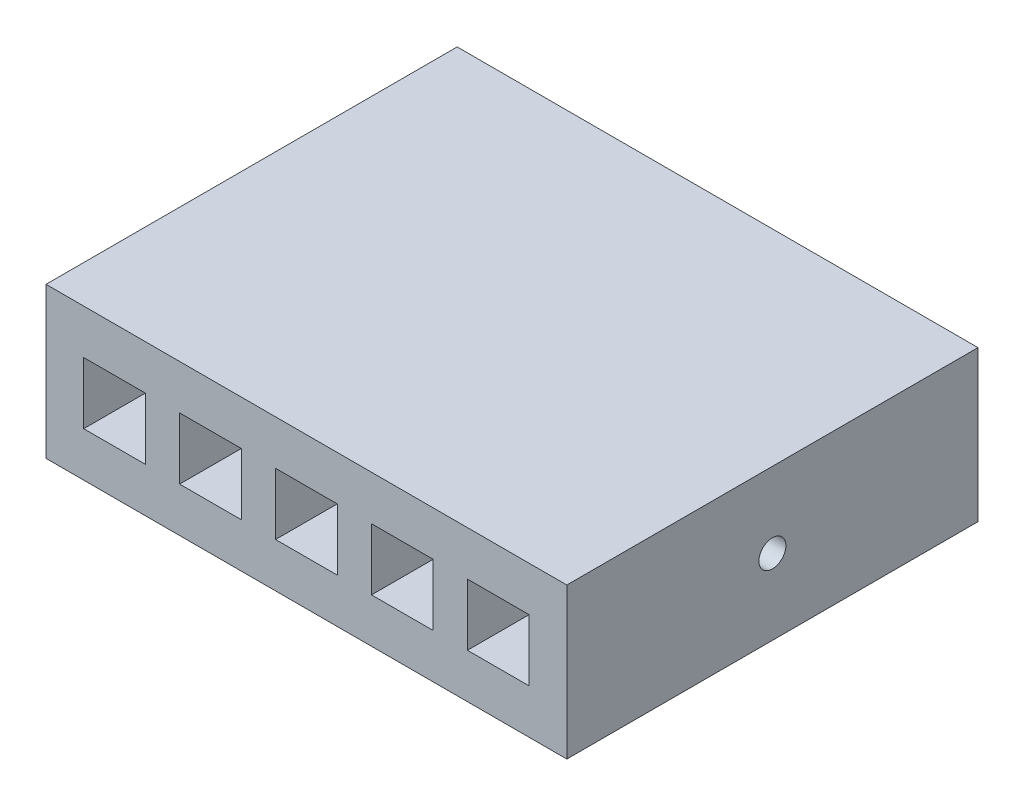
ISO-10303-21;
HEADER;
FILE_DESCRIPTION(('STEP AP214'),'2;1');
FILE_NAME('part.step','',(''),(''),'','','');
FILE_SCHEMA(('AUTOMOTIVE_DESIGN { 1 0 10303 214 1 1 1 1 }'));
ENDSEC;
DATA;
#1=APPLICATION_CONTEXT('core data for automotive mechanical design processes');
#2=APPLICATION_PROTOCOL_DEFINITION('international standard','automotive_design',2000,#1);
#3=PRODUCT_CONTEXT('',#1,'mechanical');
#4=PRODUCT('Part','Part','',(#3));
#5=PRODUCT_RELATED_PRODUCT_CATEGORY('part','',(#4));
#6=PRODUCT_DEFINITION_FORMATION('','',#4);
#7=PRODUCT_DEFINITION_CONTEXT('part definition',#1,'design');
#8=PRODUCT_DEFINITION('design','',#6,#7);
#9=PRODUCT_DEFINITION_SHAPE('','',#8);
#10=(LENGTH_UNIT() NAMED_UNIT(*) SI_UNIT(.MILLI.,.METRE.));
#11=(NAMED_UNIT(*) PLANE_ANGLE_UNIT() SI_UNIT($,.RADIAN.));
#12=(NAMED_UNIT(*) SI_UNIT($,.STERADIAN.) SOLID_ANGLE_UNIT());
#13=UNCERTAINTY_MEASURE_WITH_UNIT(LENGTH_MEASURE(1.E-05),#10,'distance_accuracy_value','');
#14=(GEOMETRIC_REPRESENTATION_CONTEXT(3) GLOBAL_UNCERTAINTY_ASSIGNED_CONTEXT((#13)) GLOBAL_UNIT_ASSIGNED_CONTEXT((#10,
#11,#12)) REPRESENTATION_CONTEXT('',''));
#15=CARTESIAN_POINT('',(0.,0.,0.));
#16=DIRECTION('',(0.,0.,1.));
#17=DIRECTION('',(1.,0.,0.));
#18=AXIS2_PLACEMENT_3D('',#15,#16,#17);
#19=CARTESIAN_POINT('',(0.,27.94,0.));
#20=DIRECTION('',(0.,0.,-1.));
#21=DIRECTION('',(-1.,0.,0.));
#22=AXIS2_PLACEMENT_3D('',#19,#20,#21);
#23=PLANE('',#22);
#24=DIRECTION('',(0.,-1.,0.));
#25=VECTOR('',#24,1.);
#26=CARTESIAN_POINT('',(71.755,0.,0.));
#27=LINE('',#26,#25);
#28=CARTESIAN_POINT('',(71.755,19.685,0.));
#29=VERTEX_POINT('',#28);
#30=CARTESIAN_POINT('',(71.755,8.255,0.));
#31=VERTEX_POINT('',#30);
#32=EDGE_CURVE('E57',#29,#31,#27,.T.);
#33=ORIENTED_EDGE('',*,*,#32,.T.);
#34=DIRECTION('',(1.,0.,0.));
#35=VECTOR('',#34,1.);
#36=CARTESIAN_POINT('',(0.,8.255,0.));
#37=LINE('',#36,#35);
#38=CARTESIAN_POINT('',(60.325,8.255,0.));
#39=VERTEX_POINT('',#38);
#40=EDGE_CURVE('E241',#39,#31,#37,.T.);
#41=ORIENTED_EDGE('',*,*,#40,.F.);
#42=DIRECTION('',(0.,-1.,0.));
#43=VECTOR('',#42,1.);
#44=CARTESIAN_POINT('',(60.325,0.,0.));
#45=LINE('',#44,#43);
#46=CARTESIAN_POINT('',(60.325,19.685,0.));
#47=VERTEX_POINT('',#46);
#48=EDGE_CURVE('E254',#47,#39,#45,.T.);
#49=ORIENTED_EDGE('',*,*,#48,.F.);
#50=DIRECTION('',(1.,0.,0.));
#51=VECTOR('',#50,1.);
#52=CARTESIAN_POINT('',(0.,19.685,0.));
#53=LINE('',#52,#51);
#54=EDGE_CURVE('E251',#47,#29,#53,.T.);
#55=ORIENTED_EDGE('',*,*,#54,.T.);
#56=EDGE_LOOP('',(#33,#41,#49,#55));
#57=FACE_BOUND('',#56,.T.);
#58=DIRECTION('',(0.,-1.,0.));
#59=VECTOR('',#58,1.);
#60=CARTESIAN_POINT('',(36.195,0.,0.));
#61=LINE('',#60,#59);
#62=CARTESIAN_POINT('',(36.195,19.685,0.));
#63=VERTEX_POINT('',#62);
#64=CARTESIAN_POINT('',(36.195,8.255,0.));
#65=VERTEX_POINT('',#64);
#66=EDGE_CURVE('E291',#63,#65,#61,.T.);
#67=ORIENTED_EDGE('',*,*,#66,.T.);
#68=DIRECTION('',(1.,0.,0.));
#69=VECTOR('',#68,1.);
#70=CARTESIAN_POINT('',(0.,8.255,0.));
#71=LINE('',#70,#69);
#72=CARTESIAN_POINT('',(24.765,8.255,0.));
#73=VERTEX_POINT('',#72);
#74=EDGE_CURVE('E301',#73,#65,#71,.T.);
#75=ORIENTED_EDGE('',*,*,#74,.F.);
#76=DIRECTION('',(0.,-1.,0.));
#77=VECTOR('',#76,1.);
#78=CARTESIAN_POINT('',(24.765,0.,0.));
#79=LINE('',#78,#77);
#80=CARTESIAN_POINT('',(24.765,19.685,0.));
#81=VERTEX_POINT('',#80);
#82=EDGE_CURVE('E315',#81,#73,#79,.T.);
#83=ORIENTED_EDGE('',*,*,#82,.F.);
#84=DIRECTION('',(1.,0.,0.));
#85=VECTOR('',#84,1.);
#86=CARTESIAN_POINT('',(0.,19.685,0.));
#87=LINE('',#86,#85);
#88=EDGE_CURVE('E312',#81,#63,#87,.T.);
#89=ORIENTED_EDGE('',*,*,#88,.T.);
#90=EDGE_LOOP('',(#67,#75,#83,#89));
#91=FACE_BOUND('',#90,.T.);
#92=DIRECTION('',(1.,0.,0.));
#93=VECTOR('',#92,1.);
#94=CARTESIAN_POINT('',(0.,0.,0.));
#95=LINE('',#94,#93);
#96=CARTESIAN_POINT('',(0.,0.,0.));
#97=VERTEX_POINT('',#96);
#98=CARTESIAN_POINT('',(96.52,0.,0.));
#99=VERTEX_POINT('',#98);
#100=EDGE_CURVE('E373',#97,#99,#95,.T.);
#101=ORIENTED_EDGE('',*,*,#100,.T.);
#102=DIRECTION('',(0.,-1.,0.));
#103=VECTOR('',#102,1.);
#104=CARTESIAN_POINT('',(96.52,27.94,0.));
#105=LINE('',#104,#103);
#106=CARTESIAN_POINT('',(96.52,27.94,0.));
#107=VERTEX_POINT('',#106);
#108=EDGE_CURVE('E42',#107,#99,#105,.T.);
#109=ORIENTED_EDGE('',*,*,#108,.F.);
#110=DIRECTION('',(1.,0.,0.));
#111=VECTOR('',#110,1.);
#112=CARTESIAN_POINT('',(0.,27.94,0.));
#113=LINE('',#112,#111);
#114=CARTESIAN_POINT('',(0.,27.94,0.));
#115=VERTEX_POINT('',#114);
#116=EDGE_CURVE('E363',#115,#107,#113,.T.);
#117=ORIENTED_EDGE('',*,*,#116,.F.);
#118=DIRECTION('',(0.,-1.,0.));
#119=VECTOR('',#118,1.);
#120=CARTESIAN_POINT('',(0.,27.94,0.));
#121=LINE('',#120,#119);
#122=EDGE_CURVE('E11',#115,#97,#121,.T.);
#123=ORIENTED_EDGE('',*,*,#122,.T.);
#124=EDGE_LOOP('',(#101,#109,#117,#123));
#125=FACE_BOUND('',#124,.T.);
#126=DIRECTION('',(0.,-1.,0.));
#127=VECTOR('',#126,1.);
#128=CARTESIAN_POINT('',(18.415,0.,0.));
#129=LINE('',#128,#127);
#130=CARTESIAN_POINT('',(18.415,19.685,0.));
#131=VERTEX_POINT('',#130);
#132=CARTESIAN_POINT('',(18.415,8.255,0.));
#133=VERTEX_POINT('',#132);
#134=EDGE_CURVE('E322',#131,#133,#129,.T.);
#135=ORIENTED_EDGE('',*,*,#134,.T.);
#136=DIRECTION('',(1.,0.,0.));
#137=VECTOR('',#136,1.);
#138=CARTESIAN_POINT('',(0.,8.255,0.));
#139=LINE('',#138,#137);
#140=CARTESIAN_POINT('',(6.985,8.255,0.));
#141=VERTEX_POINT('',#140);
#142=EDGE_CURVE('E332',#141,#133,#139,.T.);
#143=ORIENTED_EDGE('',*,*,#142,.F.);
#144=DIRECTION('',(0.,-1.,0.));
#145=VECTOR('',#144,1.);
#146=CARTESIAN_POINT('',(6.985,0.,0.));
#147=LINE('',#146,#145);
#148=CARTESIAN_POINT('',(6.985,19.685,0.));
#149=VERTEX_POINT('',#148);
#150=EDGE_CURVE('E346',#149,#141,#147,.T.);
#151=ORIENTED_EDGE('',*,*,#150,.F.);
#152=DIRECTION('',(1.,0.,0.));
#153=VECTOR('',#152,1.);
#154=CARTESIAN_POINT('',(0.,19.685,0.));
#155=LINE('',#154,#153);
#156=EDGE_CURVE('E343',#149,#131,#155,.T.);
#157=ORIENTED_EDGE('',*,*,#156,.T.);
#158=EDGE_LOOP('',(#135,#143,#151,#157));
#159=FACE_BOUND('',#158,.T.);
#160=DIRECTION('',(0.,-1.,0.));
#161=VECTOR('',#160,1.);
#162=CARTESIAN_POINT('',(53.975,0.,0.));
#163=LINE('',#162,#161);
#164=CARTESIAN_POINT('',(53.975,19.685,0.));
#165=VERTEX_POINT('',#164);
#166=CARTESIAN_POINT('',(53.975,8.255,0.));
#167=VERTEX_POINT('',#166);
#168=EDGE_CURVE('E261',#165,#167,#163,.T.);
#169=ORIENTED_EDGE('',*,*,#168,.T.);
#170=DIRECTION('',(1.,0.,0.));
#171=VECTOR('',#170,1.);
#172=CARTESIAN_POINT('',(0.,8.255,0.));
#173=LINE('',#172,#171);
#174=CARTESIAN_POINT('',(42.545,8.255,0.));
#175=VERTEX_POINT('',#174);
#176=EDGE_CURVE('E270',#175,#167,#173,.T.);
#177=ORIENTED_EDGE('',*,*,#176,.F.);
#178=DIRECTION('',(0.,-1.,0.));
#179=VECTOR('',#178,1.);
#180=CARTESIAN_POINT('',(42.545,0.,0.));
#181=LINE('',#180,#179);
#182=CARTESIAN_POINT('',(42.545,19.685,0.));
#183=VERTEX_POINT('',#182);
#184=EDGE_CURVE('E284',#183,#175,#181,.T.);
#185=ORIENTED_EDGE('',*,*,#184,.F.);
#186=DIRECTION('',(1.,0.,0.));
#187=VECTOR('',#186,1.);
#188=CARTESIAN_POINT('',(0.,19.685,0.));
#189=LINE('',#188,#187);
#190=EDGE_CURVE('E281',#183,#165,#189,.T.);
#191=ORIENTED_EDGE('',*,*,#190,.T.);
#192=EDGE_LOOP('',(#169,#177,#185,#191));
#193=FACE_BOUND('',#192,.T.);
#194=DIRECTION('',(0.,-1.,0.));
#195=VECTOR('',#194,1.);
#196=CARTESIAN_POINT('',(89.535,0.,0.));
#197=LINE('',#196,#195);
#198=CARTESIAN_POINT('',(89.535,19.685,0.));
#199=VERTEX_POINT('',#198);
#200=CARTESIAN_POINT('',(89.535,8.255,0.));
#201=VERTEX_POINT('',#200);
#202=EDGE_CURVE('E49',#199,#201,#197,.T.);
#203=ORIENTED_EDGE('',*,*,#202,.T.);
#204=DIRECTION('',(1.,0.,0.));
#205=VECTOR('',#204,1.);
#206=CARTESIAN_POINT('',(0.,8.255,0.));
#207=LINE('',#206,#205);
#208=CARTESIAN_POINT('',(78.105,8.255,0.));
#209=VERTEX_POINT('',#208);
#210=EDGE_CURVE('E216',#209,#201,#207,.T.);
#211=ORIENTED_EDGE('',*,*,#210,.F.);
#212=DIRECTION('',(0.,-1.,0.));
#213=VECTOR('',#212,1.);
#214=CARTESIAN_POINT('',(78.105,0.,0.));
#215=LINE('',#214,#213);
#216=CARTESIAN_POINT('',(78.105,19.685,0.));
#217=VERTEX_POINT('',#216);
#218=EDGE_CURVE('E219',#217,#209,#215,.T.);
#219=ORIENTED_EDGE('',*,*,#218,.F.);
#220=DIRECTION('',(1.,0.,0.));
#221=VECTOR('',#220,1.);
#222=CARTESIAN_POINT('',(0.,19.685,0.));
#223=LINE('',#222,#221);
#224=EDGE_CURVE('E228',#217,#199,#223,.T.);
#225=ORIENTED_EDGE('',*,*,#224,.T.);
#226=EDGE_LOOP('',(#203,#211,#219,#225));
#227=FACE_BOUND('',#226,.T.);
#228=ADVANCED_FACE('F34',(#57,#91,#125,#159,#193,#227),#23,.F.);
#229=CARTESIAN_POINT('',(0.,27.94,0.));
#230=DIRECTION('',(1.,0.,0.));
#231=DIRECTION('',(0.,0.,-1.));
#232=AXIS2_PLACEMENT_3D('',#229,#230,#231);
#233=PLANE('',#232);
#234=DIRECTION('',(0.,0.,1.));
#235=VECTOR('',#234,1.);
#236=CARTESIAN_POINT('',(0.,0.,0.));
#237=LINE('',#236,#235);
#238=CARTESIAN_POINT('',(0.,0.,-76.2));
#239=VERTEX_POINT('',#238);
#240=EDGE_CURVE('E353',#239,#97,#237,.T.);
#241=ORIENTED_EDGE('',*,*,#240,.T.);
#242=ORIENTED_EDGE('',*,*,#122,.F.);
#243=DIRECTION('',(0.,0.,1.));
#244=VECTOR('',#243,1.);
#245=CARTESIAN_POINT('',(0.,27.94,0.));
#246=LINE('',#245,#244);
#247=CARTESIAN_POINT('',(0.,27.94,-76.2));
#248=VERTEX_POINT('',#247);
#249=EDGE_CURVE('E360',#248,#115,#246,.T.);
#250=ORIENTED_EDGE('',*,*,#249,.F.);
#251=DIRECTION('',(0.,-1.,0.));
#252=VECTOR('',#251,1.);
#253=CARTESIAN_POINT('',(0.,27.94,-76.2));
#254=LINE('',#253,#252);
#255=EDGE_CURVE('E370',#248,#239,#254,.T.);
#256=ORIENTED_EDGE('',*,*,#255,.T.);
#257=EDGE_LOOP('',(#241,#242,#250,#256));
#258=FACE_BOUND('',#257,.T.);
#259=ADVANCED_FACE('F36',(#258),#233,.F.);
#260=CARTESIAN_POINT('',(96.52,27.94,0.));
#261=DIRECTION('',(-1.,0.,0.));
#262=DIRECTION('',(0.,0.,1.));
#263=AXIS2_PLACEMENT_3D('',#260,#261,#262);
#264=PLANE('',#263);
#265=CARTESIAN_POINT('',(96.52,13.97,-38.1));
#266=DIRECTION('',(1.,0.,0.));
#267=DIRECTION('',(0.,0.,-1.));
#268=AXIS2_PLACEMENT_3D('',#265,#266,#267);
#269=CIRCLE('',#268,2.5);
#270=CARTESIAN_POINT('',(96.52,13.97,-40.6));
#271=VERTEX_POINT('',#270);
#272=EDGE_CURVE('E222',#271,#271,#269,.T.);
#273=ORIENTED_EDGE('',*,*,#272,.F.);
#274=EDGE_LOOP('',(#273));
#275=FACE_BOUND('',#274,.T.);
#276=DIRECTION('',(0.,0.,-1.));
#277=VECTOR('',#276,1.);
#278=CARTESIAN_POINT('',(96.52,0.,0.));
#279=LINE('',#278,#277);
#280=CARTESIAN_POINT('',(96.52,0.,-76.2));
#281=VERTEX_POINT('',#280);
#282=EDGE_CURVE('E375',#99,#281,#279,.T.);
#283=ORIENTED_EDGE('',*,*,#282,.T.);
#284=DIRECTION('',(0.,-1.,0.));
#285=VECTOR('',#284,1.);
#286=CARTESIAN_POINT('',(96.52,27.94,-76.2));
#287=LINE('',#286,#285);
#288=CARTESIAN_POINT('',(96.52,27.94,-76.2));
#289=VERTEX_POINT('',#288);
#290=EDGE_CURVE('E380',#289,#281,#287,.T.);
#291=ORIENTED_EDGE('',*,*,#290,.F.);
#292=DIRECTION('',(0.,0.,-1.));
#293=VECTOR('',#292,1.);
#294=CARTESIAN_POINT('',(96.52,27.94,0.));
#295=LINE('',#294,#293);
#296=EDGE_CURVE('E366',#107,#289,#295,.T.);
#297=ORIENTED_EDGE('',*,*,#296,.F.);
#298=ORIENTED_EDGE('',*,*,#108,.T.);
#299=EDGE_LOOP('',(#283,#291,#297,#298));
#300=FACE_BOUND('',#299,.T.);
#301=ADVANCED_FACE('F387',(#275,#300),#264,.F.);
#302=CARTESIAN_POINT('',(0.,27.94,-76.2));
#303=DIRECTION('',(0.,0.,1.));
#304=DIRECTION('',(1.,0.,0.));
#305=AXIS2_PLACEMENT_3D('',#302,#303,#304);
#306=PLANE('',#305);
#307=DIRECTION('',(-1.,0.,0.));
#308=VECTOR('',#307,1.);
#309=CARTESIAN_POINT('',(0.,0.,-76.2));
#310=LINE('',#309,#308);
#311=EDGE_CURVE('E364',#281,#239,#310,.T.);
#312=ORIENTED_EDGE('',*,*,#311,.T.);
#313=ORIENTED_EDGE('',*,*,#255,.F.);
#314=DIRECTION('',(-1.,0.,0.));
#315=VECTOR('',#314,1.);
#316=CARTESIAN_POINT('',(0.,27.94,-76.2));
#317=LINE('',#316,#315);
#318=EDGE_CURVE('E368',#289,#248,#317,.T.);
#319=ORIENTED_EDGE('',*,*,#318,.F.);
#320=ORIENTED_EDGE('',*,*,#290,.T.);
#321=EDGE_LOOP('',(#312,#313,#319,#320));
#322=FACE_BOUND('',#321,.T.);
#323=ADVANCED_FACE('F396',(#322),#306,.F.);
#324=CARTESIAN_POINT('',(0.,27.94,0.));
#325=DIRECTION('',(0.,-1.,0.));
#326=DIRECTION('',(0.,0.,-1.));
#327=AXIS2_PLACEMENT_3D('',#324,#325,#326);
#328=PLANE('',#327);
#329=ORIENTED_EDGE('',*,*,#249,.T.);
#330=ORIENTED_EDGE('',*,*,#116,.T.);
#331=ORIENTED_EDGE('',*,*,#296,.T.);
#332=ORIENTED_EDGE('',*,*,#318,.T.);
#333=EDGE_LOOP('',(#329,#330,#331,#332));
#334=FACE_BOUND('',#333,.T.);
#335=ADVANCED_FACE('F402',(#334),#328,.F.);
#336=CARTESIAN_POINT('',(0.,0.,0.));
#337=DIRECTION('',(0.,-1.,0.));
#338=DIRECTION('',(0.,0.,-1.));
#339=AXIS2_PLACEMENT_3D('',#336,#337,#338);
#340=PLANE('',#339);
#341=ORIENTED_EDGE('',*,*,#240,.F.);
#342=ORIENTED_EDGE('',*,*,#311,.F.);
#343=ORIENTED_EDGE('',*,*,#282,.F.);
#344=ORIENTED_EDGE('',*,*,#100,.F.);
#345=EDGE_LOOP('',(#341,#342,#343,#344));
#346=FACE_BOUND('',#345,.T.);
#347=ADVANCED_FACE('F393',(#346),#340,.T.);
#348=CARTESIAN_POINT('',(18.415,0.,-11.43));
#349=DIRECTION('',(-1.,0.,0.));
#350=DIRECTION('',(0.,-1.,0.));
#351=AXIS2_PLACEMENT_3D('',#348,#349,#350);
#352=PLANE('',#351);
#353=ORIENTED_EDGE('',*,*,#134,.F.);
#354=DIRECTION('',(0.,0.,1.));
#355=VECTOR('',#354,1.);
#356=CARTESIAN_POINT('',(18.415,19.685,-11.43));
#357=LINE('',#356,#355);
#358=CARTESIAN_POINT('',(18.415,19.685,-11.43));
#359=VERTEX_POINT('',#358);
#360=EDGE_CURVE('E340',#359,#131,#357,.T.);
#361=ORIENTED_EDGE('',*,*,#360,.F.);
#362=DIRECTION('',(0.,-1.,0.));
#363=VECTOR('',#362,1.);
#364=CARTESIAN_POINT('',(18.415,0.,-11.43));
#365=LINE('',#364,#363);
#366=CARTESIAN_POINT('',(18.415,8.255,-11.43));
#367=VERTEX_POINT('',#366);
#368=EDGE_CURVE('E329',#359,#367,#365,.T.);
#369=ORIENTED_EDGE('',*,*,#368,.T.);
#370=DIRECTION('',(0.,0.,1.));
#371=VECTOR('',#370,1.);
#372=CARTESIAN_POINT('',(18.415,8.255,-11.43));
#373=LINE('',#372,#371);
#374=EDGE_CURVE('E351',#367,#133,#373,.T.);
#375=ORIENTED_EDGE('',*,*,#374,.T.);
#376=EDGE_LOOP('',(#353,#361,#369,#375));
#377=FACE_BOUND('',#376,.T.);
#378=ADVANCED_FACE('F497',(#377),#352,.T.);
#379=CARTESIAN_POINT('',(0.,8.255,-11.43));
#380=DIRECTION('',(0.,-1.,0.));
#381=DIRECTION('',(0.,0.,-1.));
#382=AXIS2_PLACEMENT_3D('',#379,#380,#381);
#383=PLANE('',#382);
#384=ORIENTED_EDGE('',*,*,#142,.T.);
#385=ORIENTED_EDGE('',*,*,#374,.F.);
#386=DIRECTION('',(1.,0.,0.));
#387=VECTOR('',#386,1.);
#388=CARTESIAN_POINT('',(0.,8.255,-11.43));
#389=LINE('',#388,#387);
#390=CARTESIAN_POINT('',(6.985,8.255,-11.43));
#391=VERTEX_POINT('',#390);
#392=EDGE_CURVE('E337',#391,#367,#389,.T.);
#393=ORIENTED_EDGE('',*,*,#392,.F.);
#394=DIRECTION('',(0.,0.,1.));
#395=VECTOR('',#394,1.);
#396=CARTESIAN_POINT('',(6.985,8.255,-11.43));
#397=LINE('',#396,#395);
#398=EDGE_CURVE('E354',#391,#141,#397,.T.);
#399=ORIENTED_EDGE('',*,*,#398,.T.);
#400=EDGE_LOOP('',(#384,#385,#393,#399));
#401=FACE_BOUND('',#400,.T.);
#402=ADVANCED_FACE('F493',(#401),#383,.F.);
#403=CARTESIAN_POINT('',(6.985,0.,-11.43));
#404=DIRECTION('',(-1.,0.,0.));
#405=DIRECTION('',(0.,0.,1.));
#406=AXIS2_PLACEMENT_3D('',#403,#404,#405);
#407=PLANE('',#406);
#408=ORIENTED_EDGE('',*,*,#150,.T.);
#409=ORIENTED_EDGE('',*,*,#398,.F.);
#410=DIRECTION('',(0.,-1.,0.));
#411=VECTOR('',#410,1.);
#412=CARTESIAN_POINT('',(6.985,0.,-11.43));
#413=LINE('',#412,#411);
#414=CARTESIAN_POINT('',(6.985,19.685,-11.43));
#415=VERTEX_POINT('',#414);
#416=EDGE_CURVE('E334',#415,#391,#413,.T.);
#417=ORIENTED_EDGE('',*,*,#416,.F.);
#418=DIRECTION('',(0.,0.,1.));
#419=VECTOR('',#418,1.);
#420=CARTESIAN_POINT('',(6.985,19.685,-11.43));
#421=LINE('',#420,#419);
#422=EDGE_CURVE('E356',#415,#149,#421,.T.);
#423=ORIENTED_EDGE('',*,*,#422,.T.);
#424=EDGE_LOOP('',(#408,#409,#417,#423));
#425=FACE_BOUND('',#424,.T.);
#426=ADVANCED_FACE('F496',(#425),#407,.F.);
#427=CARTESIAN_POINT('',(0.,19.685,-11.43));
#428=DIRECTION('',(0.,-1.,0.));
#429=DIRECTION('',(0.,0.,-1.));
#430=AXIS2_PLACEMENT_3D('',#427,#428,#429);
#431=PLANE('',#430);
#432=ORIENTED_EDGE('',*,*,#156,.F.);
#433=ORIENTED_EDGE('',*,*,#422,.F.);
#434=DIRECTION('',(1.,0.,0.));
#435=VECTOR('',#434,1.);
#436=CARTESIAN_POINT('',(0.,19.685,-11.43));
#437=LINE('',#436,#435);
#438=EDGE_CURVE('E331',#415,#359,#437,.T.);
#439=ORIENTED_EDGE('',*,*,#438,.T.);
#440=ORIENTED_EDGE('',*,*,#360,.T.);
#441=EDGE_LOOP('',(#432,#433,#439,#440));
#442=FACE_BOUND('',#441,.T.);
#443=ADVANCED_FACE('F491',(#442),#431,.T.);
#444=CARTESIAN_POINT('',(0.,0.,-11.43));
#445=DIRECTION('',(0.,0.,1.));
#446=DIRECTION('',(1.,0.,0.));
#447=AXIS2_PLACEMENT_3D('',#444,#445,#446);
#448=PLANE('',#447);
#449=ORIENTED_EDGE('',*,*,#368,.F.);
#450=ORIENTED_EDGE('',*,*,#438,.F.);
#451=ORIENTED_EDGE('',*,*,#416,.T.);
#452=ORIENTED_EDGE('',*,*,#392,.T.);
#453=EDGE_LOOP('',(#449,#450,#451,#452));
#454=FACE_BOUND('',#453,.T.);
#455=ADVANCED_FACE('F487',(#454),#448,.T.);
#456=CARTESIAN_POINT('',(36.195,0.,-11.43));
#457=DIRECTION('',(-1.,0.,0.));
#458=DIRECTION('',(0.,0.,1.));
#459=AXIS2_PLACEMENT_3D('',#456,#457,#458);
#460=PLANE('',#459);
#461=ORIENTED_EDGE('',*,*,#66,.F.);
#462=DIRECTION('',(0.,0.,1.));
#463=VECTOR('',#462,1.);
#464=CARTESIAN_POINT('',(36.195,19.685,-11.43));
#465=LINE('',#464,#463);
#466=CARTESIAN_POINT('',(36.195,19.685,-11.43));
#467=VERTEX_POINT('',#466);
#468=EDGE_CURVE('E309',#467,#63,#465,.T.);
#469=ORIENTED_EDGE('',*,*,#468,.F.);
#470=DIRECTION('',(0.,-1.,0.));
#471=VECTOR('',#470,1.);
#472=CARTESIAN_POINT('',(36.195,0.,-11.43));
#473=LINE('',#472,#471);
#474=CARTESIAN_POINT('',(36.195,8.255,-11.43));
#475=VERTEX_POINT('',#474);
#476=EDGE_CURVE('E298',#467,#475,#473,.T.);
#477=ORIENTED_EDGE('',*,*,#476,.T.);
#478=DIRECTION('',(0.,0.,1.));
#479=VECTOR('',#478,1.);
#480=CARTESIAN_POINT('',(36.195,8.255,-11.43));
#481=LINE('',#480,#479);
#482=EDGE_CURVE('E320',#475,#65,#481,.T.);
#483=ORIENTED_EDGE('',*,*,#482,.T.);
#484=EDGE_LOOP('',(#461,#469,#477,#483));
#485=FACE_BOUND('',#484,.T.);
#486=ADVANCED_FACE('F477',(#485),#460,.T.);
#487=CARTESIAN_POINT('',(0.,8.255,-11.43));
#488=DIRECTION('',(0.,-1.,0.));
#489=DIRECTION('',(0.,0.,-1.));
#490=AXIS2_PLACEMENT_3D('',#487,#488,#489);
#491=PLANE('',#490);
#492=ORIENTED_EDGE('',*,*,#74,.T.);
#493=ORIENTED_EDGE('',*,*,#482,.F.);
#494=DIRECTION('',(1.,0.,0.));
#495=VECTOR('',#494,1.);
#496=CARTESIAN_POINT('',(0.,8.255,-11.43));
#497=LINE('',#496,#495);
#498=CARTESIAN_POINT('',(24.765,8.255,-11.43));
#499=VERTEX_POINT('',#498);
#500=EDGE_CURVE('E306',#499,#475,#497,.T.);
#501=ORIENTED_EDGE('',*,*,#500,.F.);
#502=DIRECTION('',(0.,0.,1.));
#503=VECTOR('',#502,1.);
#504=CARTESIAN_POINT('',(24.765,8.255,-11.43));
#505=LINE('',#504,#503);
#506=EDGE_CURVE('E323',#499,#73,#505,.T.);
#507=ORIENTED_EDGE('',*,*,#506,.T.);
#508=EDGE_LOOP('',(#492,#493,#501,#507));
#509=FACE_BOUND('',#508,.T.);
#510=ADVANCED_FACE('F473',(#509),#491,.F.);
#511=CARTESIAN_POINT('',(24.765,0.,-11.43));
#512=DIRECTION('',(-1.,0.,0.));
#513=DIRECTION('',(0.,0.,1.));
#514=AXIS2_PLACEMENT_3D('',#511,#512,#513);
#515=PLANE('',#514);
#516=ORIENTED_EDGE('',*,*,#82,.T.);
#517=ORIENTED_EDGE('',*,*,#506,.F.);
#518=DIRECTION('',(0.,-1.,0.));
#519=VECTOR('',#518,1.);
#520=CARTESIAN_POINT('',(24.765,0.,-11.43));
#521=LINE('',#520,#519);
#522=CARTESIAN_POINT('',(24.765,19.685,-11.43));
#523=VERTEX_POINT('',#522);
#524=EDGE_CURVE('E303',#523,#499,#521,.T.);
#525=ORIENTED_EDGE('',*,*,#524,.F.);
#526=DIRECTION('',(0.,0.,1.));
#527=VECTOR('',#526,1.);
#528=CARTESIAN_POINT('',(24.765,19.685,-11.43));
#529=LINE('',#528,#527);
#530=EDGE_CURVE('E325',#523,#81,#529,.T.);
#531=ORIENTED_EDGE('',*,*,#530,.T.);
#532=EDGE_LOOP('',(#516,#517,#525,#531));
#533=FACE_BOUND('',#532,.T.);
#534=ADVANCED_FACE('F476',(#533),#515,.F.);
#535=CARTESIAN_POINT('',(0.,19.685,-11.43));
#536=DIRECTION('',(0.,-1.,0.));
#537=DIRECTION('',(0.,0.,-1.));
#538=AXIS2_PLACEMENT_3D('',#535,#536,#537);
#539=PLANE('',#538);
#540=ORIENTED_EDGE('',*,*,#88,.F.);
#541=ORIENTED_EDGE('',*,*,#530,.F.);
#542=DIRECTION('',(1.,0.,0.));
#543=VECTOR('',#542,1.);
#544=CARTESIAN_POINT('',(0.,19.685,-11.43));
#545=LINE('',#544,#543);
#546=EDGE_CURVE('E300',#523,#467,#545,.T.);
#547=ORIENTED_EDGE('',*,*,#546,.T.);
#548=ORIENTED_EDGE('',*,*,#468,.T.);
#549=EDGE_LOOP('',(#540,#541,#547,#548));
#550=FACE_BOUND('',#549,.T.);
#551=ADVANCED_FACE('F471',(#550),#539,.T.);
#552=CARTESIAN_POINT('',(0.,0.,-11.43));
#553=DIRECTION('',(0.,0.,1.));
#554=DIRECTION('',(1.,0.,0.));
#555=AXIS2_PLACEMENT_3D('',#552,#553,#554);
#556=PLANE('',#555);
#557=ORIENTED_EDGE('',*,*,#476,.F.);
#558=ORIENTED_EDGE('',*,*,#546,.F.);
#559=ORIENTED_EDGE('',*,*,#524,.T.);
#560=ORIENTED_EDGE('',*,*,#500,.T.);
#561=EDGE_LOOP('',(#557,#558,#559,#560));
#562=FACE_BOUND('',#561,.T.);
#563=ADVANCED_FACE('F467',(#562),#556,.T.);
#564=CARTESIAN_POINT('',(53.975,0.,-11.43));
#565=DIRECTION('',(-1.,0.,0.));
#566=DIRECTION('',(0.,0.,1.));
#567=AXIS2_PLACEMENT_3D('',#564,#565,#566);
#568=PLANE('',#567);
#569=ORIENTED_EDGE('',*,*,#168,.F.);
#570=DIRECTION('',(0.,0.,1.));
#571=VECTOR('',#570,1.);
#572=CARTESIAN_POINT('',(53.975,19.685,-11.43));
#573=LINE('',#572,#571);
#574=CARTESIAN_POINT('',(53.975,19.685,-11.43));
#575=VERTEX_POINT('',#574);
#576=EDGE_CURVE('E278',#575,#165,#573,.T.);
#577=ORIENTED_EDGE('',*,*,#576,.F.);
#578=DIRECTION('',(0.,-1.,0.));
#579=VECTOR('',#578,1.);
#580=CARTESIAN_POINT('',(53.975,0.,-11.43));
#581=LINE('',#580,#579);
#582=CARTESIAN_POINT('',(53.975,8.255,-11.43));
#583=VERTEX_POINT('',#582);
#584=EDGE_CURVE('E267',#575,#583,#581,.T.);
#585=ORIENTED_EDGE('',*,*,#584,.T.);
#586=DIRECTION('',(0.,0.,1.));
#587=VECTOR('',#586,1.);
#588=CARTESIAN_POINT('',(53.975,8.255,-11.43));
#589=LINE('',#588,#587);
#590=EDGE_CURVE('E289',#583,#167,#589,.T.);
#591=ORIENTED_EDGE('',*,*,#590,.T.);
#592=EDGE_LOOP('',(#569,#577,#585,#591));
#593=FACE_BOUND('',#592,.T.);
#594=ADVANCED_FACE('F457',(#593),#568,.T.);
#595=CARTESIAN_POINT('',(0.,8.255,-11.43));
#596=DIRECTION('',(0.,-1.,0.));
#597=DIRECTION('',(0.,0.,-1.));
#598=AXIS2_PLACEMENT_3D('',#595,#596,#597);
#599=PLANE('',#598);
#600=ORIENTED_EDGE('',*,*,#176,.T.);
#601=ORIENTED_EDGE('',*,*,#590,.F.);
#602=DIRECTION('',(1.,0.,0.));
#603=VECTOR('',#602,1.);
#604=CARTESIAN_POINT('',(0.,8.255,-11.43));
#605=LINE('',#604,#603);
#606=CARTESIAN_POINT('',(42.545,8.255,-11.43));
#607=VERTEX_POINT('',#606);
#608=EDGE_CURVE('E275',#607,#583,#605,.T.);
#609=ORIENTED_EDGE('',*,*,#608,.F.);
#610=DIRECTION('',(0.,0.,1.));
#611=VECTOR('',#610,1.);
#612=CARTESIAN_POINT('',(42.545,8.255,-11.43));
#613=LINE('',#612,#611);
#614=EDGE_CURVE('E292',#607,#175,#613,.T.);
#615=ORIENTED_EDGE('',*,*,#614,.T.);
#616=EDGE_LOOP('',(#600,#601,#609,#615));
#617=FACE_BOUND('',#616,.T.);
#618=ADVANCED_FACE('F453',(#617),#599,.F.);
#619=CARTESIAN_POINT('',(42.545,0.,-11.43));
#620=DIRECTION('',(-1.,0.,0.));
#621=DIRECTION('',(0.,0.,1.));
#622=AXIS2_PLACEMENT_3D('',#619,#620,#621);
#623=PLANE('',#622);
#624=ORIENTED_EDGE('',*,*,#184,.T.);
#625=ORIENTED_EDGE('',*,*,#614,.F.);
#626=DIRECTION('',(0.,-1.,0.));
#627=VECTOR('',#626,1.);
#628=CARTESIAN_POINT('',(42.545,0.,-11.43));
#629=LINE('',#628,#627);
#630=CARTESIAN_POINT('',(42.545,19.685,-11.43));
#631=VERTEX_POINT('',#630);
#632=EDGE_CURVE('E272',#631,#607,#629,.T.);
#633=ORIENTED_EDGE('',*,*,#632,.F.);
#634=DIRECTION('',(0.,0.,1.));
#635=VECTOR('',#634,1.);
#636=CARTESIAN_POINT('',(42.545,19.685,-11.43));
#637=LINE('',#636,#635);
#638=EDGE_CURVE('E294',#631,#183,#637,.T.);
#639=ORIENTED_EDGE('',*,*,#638,.T.);
#640=EDGE_LOOP('',(#624,#625,#633,#639));
#641=FACE_BOUND('',#640,.T.);
#642=ADVANCED_FACE('F456',(#641),#623,.F.);
#643=CARTESIAN_POINT('',(0.,19.685,-11.43));
#644=DIRECTION('',(0.,-1.,0.));
#645=DIRECTION('',(0.,0.,-1.));
#646=AXIS2_PLACEMENT_3D('',#643,#644,#645);
#647=PLANE('',#646);
#648=ORIENTED_EDGE('',*,*,#190,.F.);
#649=ORIENTED_EDGE('',*,*,#638,.F.);
#650=DIRECTION('',(1.,0.,0.));
#651=VECTOR('',#650,1.);
#652=CARTESIAN_POINT('',(0.,19.685,-11.43));
#653=LINE('',#652,#651);
#654=EDGE_CURVE('E269',#631,#575,#653,.T.);
#655=ORIENTED_EDGE('',*,*,#654,.T.);
#656=ORIENTED_EDGE('',*,*,#576,.T.);
#657=EDGE_LOOP('',(#648,#649,#655,#656));
#658=FACE_BOUND('',#657,.T.);
#659=ADVANCED_FACE('F451',(#658),#647,.T.);
#660=CARTESIAN_POINT('',(0.,0.,-11.43));
#661=DIRECTION('',(0.,0.,1.));
#662=DIRECTION('',(1.,0.,0.));
#663=AXIS2_PLACEMENT_3D('',#660,#661,#662);
#664=PLANE('',#663);
#665=ORIENTED_EDGE('',*,*,#584,.F.);
#666=ORIENTED_EDGE('',*,*,#654,.F.);
#667=ORIENTED_EDGE('',*,*,#632,.T.);
#668=ORIENTED_EDGE('',*,*,#608,.T.);
#669=EDGE_LOOP('',(#665,#666,#667,#668));
#670=FACE_BOUND('',#669,.T.);
#671=ADVANCED_FACE('F448',(#670),#664,.T.);
#672=CARTESIAN_POINT('',(71.755,0.,-11.43));
#673=DIRECTION('',(-1.,0.,0.));
#674=DIRECTION('',(0.,0.,1.));
#675=AXIS2_PLACEMENT_3D('',#672,#673,#674);
#676=PLANE('',#675);
#677=ORIENTED_EDGE('',*,*,#32,.F.);
#678=DIRECTION('',(0.,0.,1.));
#679=VECTOR('',#678,1.);
#680=CARTESIAN_POINT('',(71.755,19.685,-11.43));
#681=LINE('',#680,#679);
#682=CARTESIAN_POINT('',(71.755,19.685,-11.43));
#683=VERTEX_POINT('',#682);
#684=EDGE_CURVE('E249',#683,#29,#681,.T.);
#685=ORIENTED_EDGE('',*,*,#684,.F.);
#686=DIRECTION('',(0.,-1.,0.));
#687=VECTOR('',#686,1.);
#688=CARTESIAN_POINT('',(71.755,0.,-11.43));
#689=LINE('',#688,#687);
#690=CARTESIAN_POINT('',(71.755,8.255,-11.43));
#691=VERTEX_POINT('',#690);
#692=EDGE_CURVE('E238',#683,#691,#689,.T.);
#693=ORIENTED_EDGE('',*,*,#692,.T.);
#694=DIRECTION('',(0.,0.,1.));
#695=VECTOR('',#694,1.);
#696=CARTESIAN_POINT('',(71.755,8.255,-11.43));
#697=LINE('',#696,#695);
#698=EDGE_CURVE('E259',#691,#31,#697,.T.);
#699=ORIENTED_EDGE('',*,*,#698,.T.);
#700=EDGE_LOOP('',(#677,#685,#693,#699));
#701=FACE_BOUND('',#700,.T.);
#702=ADVANCED_FACE('F438',(#701),#676,.T.);
#703=CARTESIAN_POINT('',(0.,8.255,-11.43));
#704=DIRECTION('',(0.,-1.,0.));
#705=DIRECTION('',(0.,0.,-1.));
#706=AXIS2_PLACEMENT_3D('',#703,#704,#705);
#707=PLANE('',#706);
#708=ORIENTED_EDGE('',*,*,#40,.T.);
#709=ORIENTED_EDGE('',*,*,#698,.F.);
#710=DIRECTION('',(1.,0.,0.));
#711=VECTOR('',#710,1.);
#712=CARTESIAN_POINT('',(0.,8.255,-11.43));
#713=LINE('',#712,#711);
#714=CARTESIAN_POINT('',(60.325,8.255,-11.43));
#715=VERTEX_POINT('',#714);
#716=EDGE_CURVE('E246',#715,#691,#713,.T.);
#717=ORIENTED_EDGE('',*,*,#716,.F.);
#718=DIRECTION('',(0.,0.,1.));
#719=VECTOR('',#718,1.);
#720=CARTESIAN_POINT('',(60.325,8.255,-11.43));
#721=LINE('',#720,#719);
#722=EDGE_CURVE('E262',#715,#39,#721,.T.);
#723=ORIENTED_EDGE('',*,*,#722,.T.);
#724=EDGE_LOOP('',(#708,#709,#717,#723));
#725=FACE_BOUND('',#724,.T.);
#726=ADVANCED_FACE('F434',(#725),#707,.F.);
#727=CARTESIAN_POINT('',(60.325,0.,-11.43));
#728=DIRECTION('',(-1.,0.,0.));
#729=DIRECTION('',(0.,0.,1.));
#730=AXIS2_PLACEMENT_3D('',#727,#728,#729);
#731=PLANE('',#730);
#732=ORIENTED_EDGE('',*,*,#48,.T.);
#733=ORIENTED_EDGE('',*,*,#722,.F.);
#734=DIRECTION('',(0.,-1.,0.));
#735=VECTOR('',#734,1.);
#736=CARTESIAN_POINT('',(60.325,0.,-11.43));
#737=LINE('',#736,#735);
#738=CARTESIAN_POINT('',(60.325,19.685,-11.43));
#739=VERTEX_POINT('',#738);
#740=EDGE_CURVE('E243',#739,#715,#737,.T.);
#741=ORIENTED_EDGE('',*,*,#740,.F.);
#742=DIRECTION('',(0.,0.,1.));
#743=VECTOR('',#742,1.);
#744=CARTESIAN_POINT('',(60.325,19.685,-11.43));
#745=LINE('',#744,#743);
#746=EDGE_CURVE('E264',#739,#47,#745,.T.);
#747=ORIENTED_EDGE('',*,*,#746,.T.);
#748=EDGE_LOOP('',(#732,#733,#741,#747));
#749=FACE_BOUND('',#748,.T.);
#750=ADVANCED_FACE('F437',(#749),#731,.F.);
#751=CARTESIAN_POINT('',(0.,19.685,-11.43));
#752=DIRECTION('',(0.,-1.,0.));
#753=DIRECTION('',(0.,0.,-1.));
#754=AXIS2_PLACEMENT_3D('',#751,#752,#753);
#755=PLANE('',#754);
#756=ORIENTED_EDGE('',*,*,#54,.F.);
#757=ORIENTED_EDGE('',*,*,#746,.F.);
#758=DIRECTION('',(1.,0.,0.));
#759=VECTOR('',#758,1.);
#760=CARTESIAN_POINT('',(0.,19.685,-11.43));
#761=LINE('',#760,#759);
#762=EDGE_CURVE('E240',#739,#683,#761,.T.);
#763=ORIENTED_EDGE('',*,*,#762,.T.);
#764=ORIENTED_EDGE('',*,*,#684,.T.);
#765=EDGE_LOOP('',(#756,#757,#763,#764));
#766=FACE_BOUND('',#765,.T.);
#767=ADVANCED_FACE('F432',(#766),#755,.T.);
#768=CARTESIAN_POINT('',(0.,0.,-11.43));
#769=DIRECTION('',(0.,0.,1.));
#770=DIRECTION('',(1.,0.,0.));
#771=AXIS2_PLACEMENT_3D('',#768,#769,#770);
#772=PLANE('',#771);
#773=ORIENTED_EDGE('',*,*,#692,.F.);
#774=ORIENTED_EDGE('',*,*,#762,.F.);
#775=ORIENTED_EDGE('',*,*,#740,.T.);
#776=ORIENTED_EDGE('',*,*,#716,.T.);
#777=EDGE_LOOP('',(#773,#774,#775,#776));
#778=FACE_BOUND('',#777,.T.);
#779=ADVANCED_FACE('F423',(#778),#772,.T.);
#780=CARTESIAN_POINT('',(89.535,0.,-11.43));
#781=DIRECTION('',(-1.,0.,0.));
#782=DIRECTION('',(0.,0.,1.));
#783=AXIS2_PLACEMENT_3D('',#780,#781,#782);
#784=PLANE('',#783);
#785=ORIENTED_EDGE('',*,*,#202,.F.);
#786=DIRECTION('',(0.,0.,1.));
#787=VECTOR('',#786,1.);
#788=CARTESIAN_POINT('',(89.535,19.685,-11.43));
#789=LINE('',#788,#787);
#790=CARTESIAN_POINT('',(89.535,19.685,-11.43));
#791=VERTEX_POINT('',#790);
#792=EDGE_CURVE('E199',#791,#199,#789,.T.);
#793=ORIENTED_EDGE('',*,*,#792,.F.);
#794=DIRECTION('',(0.,-1.,0.));
#795=VECTOR('',#794,1.);
#796=CARTESIAN_POINT('',(89.535,0.,-11.43));
#797=LINE('',#796,#795);
#798=CARTESIAN_POINT('',(89.535,8.255,-11.43));
#799=VERTEX_POINT('',#798);
#800=EDGE_CURVE('E207',#791,#799,#797,.T.);
#801=ORIENTED_EDGE('',*,*,#800,.T.);
#802=DIRECTION('',(0.,0.,1.));
#803=VECTOR('',#802,1.);
#804=CARTESIAN_POINT('',(89.535,8.255,-11.43));
#805=LINE('',#804,#803);
#806=EDGE_CURVE('E233',#799,#201,#805,.T.);
#807=ORIENTED_EDGE('',*,*,#806,.T.);
#808=EDGE_LOOP('',(#785,#793,#801,#807));
#809=FACE_BOUND('',#808,.T.);
#810=ADVANCED_FACE('F209',(#809),#784,.T.);
#811=CARTESIAN_POINT('',(0.,8.255,-11.43));
#812=DIRECTION('',(0.,-1.,0.));
#813=DIRECTION('',(0.,0.,-1.));
#814=AXIS2_PLACEMENT_3D('',#811,#812,#813);
#815=PLANE('',#814);
#816=ORIENTED_EDGE('',*,*,#210,.T.);
#817=ORIENTED_EDGE('',*,*,#806,.F.);
#818=DIRECTION('',(1.,0.,0.));
#819=VECTOR('',#818,1.);
#820=CARTESIAN_POINT('',(0.,8.255,-11.43));
#821=LINE('',#820,#819);
#822=CARTESIAN_POINT('',(78.105,8.255,-11.43));
#823=VERTEX_POINT('',#822);
#824=EDGE_CURVE('E211',#823,#799,#821,.T.);
#825=ORIENTED_EDGE('',*,*,#824,.F.);
#826=DIRECTION('',(0.,0.,1.));
#827=VECTOR('',#826,1.);
#828=CARTESIAN_POINT('',(78.105,8.255,-11.43));
#829=LINE('',#828,#827);
#830=EDGE_CURVE('E235',#823,#209,#829,.T.);
#831=ORIENTED_EDGE('',*,*,#830,.T.);
#832=EDGE_LOOP('',(#816,#817,#825,#831));
#833=FACE_BOUND('',#832,.T.);
#834=ADVANCED_FACE('F415',(#833),#815,.F.);
#835=CARTESIAN_POINT('',(78.105,0.,-11.43));
#836=DIRECTION('',(-1.,0.,0.));
#837=DIRECTION('',(0.,0.,1.));
#838=AXIS2_PLACEMENT_3D('',#835,#836,#837);
#839=PLANE('',#838);
#840=ORIENTED_EDGE('',*,*,#218,.T.);
#841=ORIENTED_EDGE('',*,*,#830,.F.);
#842=DIRECTION('',(0.,-1.,0.));
#843=VECTOR('',#842,1.);
#844=CARTESIAN_POINT('',(78.105,0.,-11.43));
#845=LINE('',#844,#843);
#846=CARTESIAN_POINT('',(78.105,19.685,-11.43));
#847=VERTEX_POINT('',#846);
#848=EDGE_CURVE('E206',#847,#823,#845,.T.);
#849=ORIENTED_EDGE('',*,*,#848,.F.);
#850=DIRECTION('',(0.,0.,1.));
#851=VECTOR('',#850,1.);
#852=CARTESIAN_POINT('',(78.105,19.685,-11.43));
#853=LINE('',#852,#851);
#854=EDGE_CURVE('E201',#847,#217,#853,.T.);
#855=ORIENTED_EDGE('',*,*,#854,.T.);
#856=EDGE_LOOP('',(#840,#841,#849,#855));
#857=FACE_BOUND('',#856,.T.);
#858=ADVANCED_FACE('F413',(#857),#839,.F.);
#859=CARTESIAN_POINT('',(0.,19.685,-11.43));
#860=DIRECTION('',(0.,-1.,0.));
#861=DIRECTION('',(0.,0.,-1.));
#862=AXIS2_PLACEMENT_3D('',#859,#860,#861);
#863=PLANE('',#862);
#864=ORIENTED_EDGE('',*,*,#224,.F.);
#865=ORIENTED_EDGE('',*,*,#854,.F.);
#866=DIRECTION('',(1.,0.,0.));
#867=VECTOR('',#866,1.);
#868=CARTESIAN_POINT('',(0.,19.685,-11.43));
#869=LINE('',#868,#867);
#870=EDGE_CURVE('E196',#847,#791,#869,.T.);
#871=ORIENTED_EDGE('',*,*,#870,.T.);
#872=ORIENTED_EDGE('',*,*,#792,.T.);
#873=EDGE_LOOP('',(#864,#865,#871,#872));
#874=FACE_BOUND('',#873,.T.);
#875=ADVANCED_FACE('F198',(#874),#863,.T.);
#876=CARTESIAN_POINT('',(0.,0.,-11.43));
#877=DIRECTION('',(0.,0.,1.));
#878=DIRECTION('',(1.,0.,0.));
#879=AXIS2_PLACEMENT_3D('',#876,#877,#878);
#880=PLANE('',#879);
#881=ORIENTED_EDGE('',*,*,#800,.F.);
#882=ORIENTED_EDGE('',*,*,#870,.F.);
#883=ORIENTED_EDGE('',*,*,#848,.T.);
#884=ORIENTED_EDGE('',*,*,#824,.T.);
#885=EDGE_LOOP('',(#881,#882,#883,#884));
#886=FACE_BOUND('',#885,.T.);
#887=ADVANCED_FACE('F214',(#886),#880,.T.);
#888=CARTESIAN_POINT('',(83.82,13.97,-38.1));
#889=DIRECTION('',(1.,0.,0.));
#890=DIRECTION('',(0.,0.,-1.));
#891=AXIS2_PLACEMENT_3D('',#888,#889,#890);
#892=CYLINDRICAL_SURFACE('',#891,2.5);
#893=CARTESIAN_POINT('',(83.82,13.97,-38.1));
#894=DIRECTION('',(1.,0.,0.));
#895=DIRECTION('',(0.,0.,-1.));
#896=AXIS2_PLACEMENT_3D('',#893,#894,#895);
#897=CIRCLE('',#896,2.5);
#898=CARTESIAN_POINT('',(83.82,13.97,-40.6));
#899=VERTEX_POINT('',#898);
#900=EDGE_CURVE('E229',#899,#899,#897,.T.);
#901=ORIENTED_EDGE('',*,*,#900,.F.);
#902=EDGE_LOOP('',(#901));
#903=FACE_BOUND('',#902,.T.);
#904=ORIENTED_EDGE('',*,*,#272,.T.);
#905=EDGE_LOOP('',(#904));
#906=FACE_BOUND('',#905,.T.);
#907=ADVANCED_FACE('F527',(#903,#906),#892,.F.);
#908=CARTESIAN_POINT('',(83.82,13.97,-38.1));
#909=DIRECTION('',(1.,0.,0.));
#910=DIRECTION('',(0.,0.,-1.));
#911=AXIS2_PLACEMENT_3D('',#908,#909,#910);
#912=PLANE('',#911);
#913=ORIENTED_EDGE('',*,*,#900,.T.);
#914=EDGE_LOOP('',(#913));
#915=FACE_BOUND('',#914,.T.);
#916=ADVANCED_FACE('F525',(#915),#912,.T.);
#917=CLOSED_SHELL('',(#228,#259,#301,#323,#335,#347,#378,#402,#426,#443,#455,#486,#510,#534,
#551,#563,#594,#618,#642,#659,#671,#702,#726,#750,#767,#779,#810,#834,#858,#875,#887,#907,#916));
#918=MANIFOLD_SOLID_BREP('B2',#917);
#919=ADVANCED_BREP_SHAPE_REPRESENTATION('',(#18,#918),#14);
#920=SHAPE_DEFINITION_REPRESENTATION(#9,#919);
ENDSEC;
END-ISO-10303-21;
